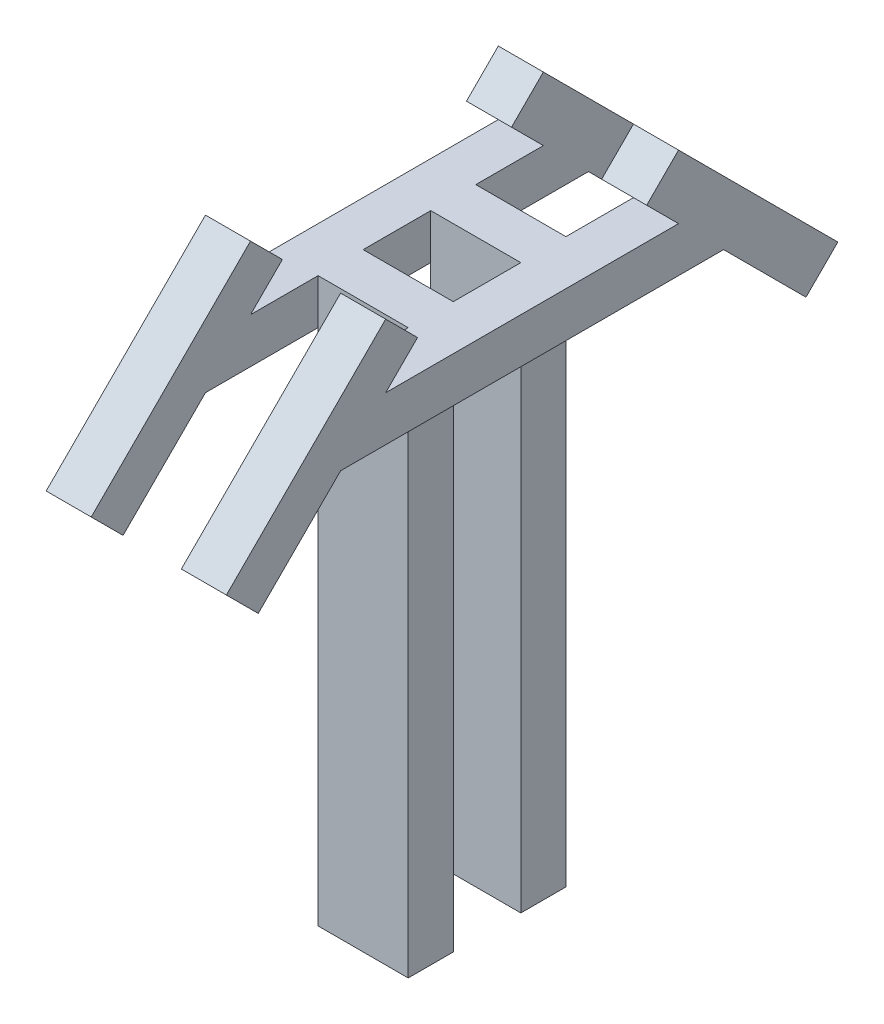
ISO-10303-21;
HEADER;
FILE_DESCRIPTION(('STEP AP214'),'2;1');
FILE_NAME('part.step','',(''),(''),'','','');
FILE_SCHEMA(('AUTOMOTIVE_DESIGN { 1 0 10303 214 1 1 1 1 }'));
ENDSEC;
DATA;
#1=APPLICATION_CONTEXT('core data for automotive mechanical design processes');
#2=APPLICATION_PROTOCOL_DEFINITION('international standard','automotive_design',2000,#1);
#3=PRODUCT_CONTEXT('',#1,'mechanical');
#4=PRODUCT('Part','Part','',(#3));
#5=PRODUCT_RELATED_PRODUCT_CATEGORY('part','',(#4));
#6=PRODUCT_DEFINITION_FORMATION('','',#4);
#7=PRODUCT_DEFINITION_CONTEXT('part definition',#1,'design');
#8=PRODUCT_DEFINITION('design','',#6,#7);
#9=PRODUCT_DEFINITION_SHAPE('','',#8);
#10=(LENGTH_UNIT() NAMED_UNIT(*) SI_UNIT(.MILLI.,.METRE.));
#11=(NAMED_UNIT(*) PLANE_ANGLE_UNIT() SI_UNIT($,.RADIAN.));
#12=(NAMED_UNIT(*) SI_UNIT($,.STERADIAN.) SOLID_ANGLE_UNIT());
#13=UNCERTAINTY_MEASURE_WITH_UNIT(LENGTH_MEASURE(1.E-05),#10,'distance_accuracy_value','');
#14=(GEOMETRIC_REPRESENTATION_CONTEXT(3) GLOBAL_UNCERTAINTY_ASSIGNED_CONTEXT((#13)) GLOBAL_UNIT_ASSIGNED_CONTEXT((#10,
#11,#12)) REPRESENTATION_CONTEXT('',''));
#15=CARTESIAN_POINT('',(0.,0.,0.));
#16=DIRECTION('',(0.,0.,1.));
#17=DIRECTION('',(1.,0.,0.));
#18=AXIS2_PLACEMENT_3D('',#15,#16,#17);
#19=CARTESIAN_POINT('',(0.,500.,0.));
#20=DIRECTION('',(1.,0.,0.));
#21=DIRECTION('',(0.,0.,-1.));
#22=AXIS2_PLACEMENT_3D('',#19,#20,#21);
#23=PLANE('',#22);
#24=DIRECTION('',(0.,0.,1.));
#25=VECTOR('',#24,1.);
#26=CARTESIAN_POINT('',(0.,460.,-200.));
#27=LINE('',#26,#25);
#28=CARTESIAN_POINT('',(0.,460.,0.));
#29=VERTEX_POINT('',#28);
#30=CARTESIAN_POINT('',(0.,460.,40.));
#31=VERTEX_POINT('',#30);
#32=EDGE_CURVE('E630',#29,#31,#27,.T.);
#33=ORIENTED_EDGE('',*,*,#32,.F.);
#34=DIRECTION('',(0.,-1.,0.));
#35=VECTOR('',#34,1.);
#36=CARTESIAN_POINT('',(0.,500.,0.));
#37=LINE('',#36,#35);
#38=CARTESIAN_POINT('',(0.,0.,0.));
#39=VERTEX_POINT('',#38);
#40=EDGE_CURVE('E479',#29,#39,#37,.T.);
#41=ORIENTED_EDGE('',*,*,#40,.T.);
#42=DIRECTION('',(0.,0.,1.));
#43=VECTOR('',#42,1.);
#44=CARTESIAN_POINT('',(0.,0.,0.));
#45=LINE('',#44,#43);
#46=CARTESIAN_POINT('',(0.,0.,40.));
#47=VERTEX_POINT('',#46);
#48=EDGE_CURVE('E472',#39,#47,#45,.T.);
#49=ORIENTED_EDGE('',*,*,#48,.T.);
#50=DIRECTION('',(0.,-1.,0.));
#51=VECTOR('',#50,1.);
#52=CARTESIAN_POINT('',(0.,500.,40.));
#53=LINE('',#52,#51);
#54=EDGE_CURVE('E497',#31,#47,#53,.T.);
#55=ORIENTED_EDGE('',*,*,#54,.F.);
#56=EDGE_LOOP('',(#33,#41,#49,#55));
#57=FACE_BOUND('',#56,.T.);
#58=ADVANCED_FACE('F37',(#57),#23,.F.);
#59=CARTESIAN_POINT('',(0.,500.,-100.));
#60=DIRECTION('',(1.,0.,0.));
#61=DIRECTION('',(0.,0.,-1.));
#62=AXIS2_PLACEMENT_3D('',#59,#60,#61);
#63=PLANE('',#62);
#64=CARTESIAN_POINT('',(0.,460.,-100.));
#65=VERTEX_POINT('',#64);
#66=CARTESIAN_POINT('',(0.,460.,-60.));
#67=VERTEX_POINT('',#66);
#68=EDGE_CURVE('E419',#65,#67,#27,.T.);
#69=ORIENTED_EDGE('',*,*,#68,.F.);
#70=DIRECTION('',(0.,-1.,0.));
#71=VECTOR('',#70,1.);
#72=CARTESIAN_POINT('',(0.,500.,-100.));
#73=LINE('',#72,#71);
#74=CARTESIAN_POINT('',(0.,0.,-100.));
#75=VERTEX_POINT('',#74);
#76=EDGE_CURVE('E433',#65,#75,#73,.T.);
#77=ORIENTED_EDGE('',*,*,#76,.T.);
#78=DIRECTION('',(0.,0.,1.));
#79=VECTOR('',#78,1.);
#80=CARTESIAN_POINT('',(0.,0.,-100.));
#81=LINE('',#80,#79);
#82=CARTESIAN_POINT('',(0.,0.,-60.));
#83=VERTEX_POINT('',#82);
#84=EDGE_CURVE('E427',#75,#83,#81,.T.);
#85=ORIENTED_EDGE('',*,*,#84,.T.);
#86=DIRECTION('',(0.,-1.,0.));
#87=VECTOR('',#86,1.);
#88=CARTESIAN_POINT('',(0.,500.,-60.));
#89=LINE('',#88,#87);
#90=EDGE_CURVE('E54',#67,#83,#89,.T.);
#91=ORIENTED_EDGE('',*,*,#90,.F.);
#92=EDGE_LOOP('',(#69,#77,#85,#91));
#93=FACE_BOUND('',#92,.T.);
#94=ADVANCED_FACE('F656',(#93),#63,.F.);
#95=CARTESIAN_POINT('',(80.,0.,0.));
#96=DIRECTION('',(1.,0.,0.));
#97=DIRECTION('',(0.,0.,-1.));
#98=AXIS2_PLACEMENT_3D('',#95,#96,#97);
#99=PLANE('',#98);
#100=DIRECTION('',(0.,-1.,0.));
#101=VECTOR('',#100,1.);
#102=CARTESIAN_POINT('',(80.,500.,-60.));
#103=LINE('',#102,#101);
#104=CARTESIAN_POINT('',(80.,500.,-60.));
#105=VERTEX_POINT('',#104);
#106=CARTESIAN_POINT('',(80.,460.,-60.));
#107=VERTEX_POINT('',#106);
#108=EDGE_CURVE('E62',#105,#107,#103,.T.);
#109=ORIENTED_EDGE('',*,*,#108,.T.);
#110=DIRECTION('',(0.,0.,-1.));
#111=VECTOR('',#110,1.);
#112=CARTESIAN_POINT('',(80.,460.,140.));
#113=LINE('',#112,#111);
#114=CARTESIAN_POINT('',(80.,460.,0.));
#115=VERTEX_POINT('',#114);
#116=EDGE_CURVE('E47',#115,#107,#113,.T.);
#117=ORIENTED_EDGE('',*,*,#116,.F.);
#118=DIRECTION('',(0.,-1.,0.));
#119=VECTOR('',#118,1.);
#120=CARTESIAN_POINT('',(80.,500.,0.));
#121=LINE('',#120,#119);
#122=CARTESIAN_POINT('',(80.,500.,0.));
#123=VERTEX_POINT('',#122);
#124=EDGE_CURVE('E493',#123,#115,#121,.T.);
#125=ORIENTED_EDGE('',*,*,#124,.F.);
#126=DIRECTION('',(0.,0.,1.));
#127=VECTOR('',#126,1.);
#128=CARTESIAN_POINT('',(80.,500.,140.));
#129=LINE('',#128,#127);
#130=EDGE_CURVE('E466',#105,#123,#129,.T.);
#131=ORIENTED_EDGE('',*,*,#130,.F.);
#132=EDGE_LOOP('',(#109,#117,#125,#131));
#133=FACE_BOUND('',#132,.T.);
#134=ADVANCED_FACE('F525',(#133),#99,.F.);
#135=CARTESIAN_POINT('',(80.,500.,-160.000000000001));
#136=VERTEX_POINT('',#135);
#137=CARTESIAN_POINT('',(80.,500.,-100.));
#138=VERTEX_POINT('',#137);
#139=EDGE_CURVE('E459',#136,#138,#129,.T.);
#140=ORIENTED_EDGE('',*,*,#139,.F.);
#141=DIRECTION('',(0.,0.707106781186551,0.707106781186544));
#142=VECTOR('',#141,1.);
#143=CARTESIAN_POINT('',(80.,528.284271247462,-131.715728752539));
#144=LINE('',#143,#142);
#145=CARTESIAN_POINT('',(80.,528.284271247462,-131.715728752539));
#146=VERTEX_POINT('',#145);
#147=EDGE_CURVE('E321',#136,#146,#144,.T.);
#148=ORIENTED_EDGE('',*,*,#147,.T.);
#149=DIRECTION('',(0.,-0.707106781186544,0.707106781186551));
#150=VECTOR('',#149,1.);
#151=CARTESIAN_POINT('',(80.,556.568542494924,-160.000000000001));
#152=LINE('',#151,#150);
#153=CARTESIAN_POINT('',(80.,556.568542494924,-160.000000000001));
#154=VERTEX_POINT('',#153);
#155=EDGE_CURVE('E327',#154,#146,#152,.T.);
#156=ORIENTED_EDGE('',*,*,#155,.F.);
#157=DIRECTION('',(0.,0.707106781186551,0.707106781186544));
#158=VECTOR('',#157,1.);
#159=CARTESIAN_POINT('',(80.,556.568542494924,-160.000000000001));
#160=LINE('',#159,#158);
#161=CARTESIAN_POINT('',(80.,415.147186257613,-301.42135623731));
#162=VERTEX_POINT('',#161);
#163=EDGE_CURVE('E313',#162,#154,#160,.T.);
#164=ORIENTED_EDGE('',*,*,#163,.F.);
#165=DIRECTION('',(0.,-0.707106781186544,0.707106781186551));
#166=VECTOR('',#165,1.);
#167=CARTESIAN_POINT('',(80.,415.147186257613,-301.42135623731));
#168=LINE('',#167,#166);
#169=CARTESIAN_POINT('',(80.,386.862915010152,-273.137084989847));
#170=VERTEX_POINT('',#169);
#171=EDGE_CURVE('E330',#162,#170,#168,.T.);
#172=ORIENTED_EDGE('',*,*,#171,.T.);
#173=CARTESIAN_POINT('',(80.,460.,-200.));
#174=VERTEX_POINT('',#173);
#175=EDGE_CURVE('E322',#170,#174,#144,.T.);
#176=ORIENTED_EDGE('',*,*,#175,.T.);
#177=CARTESIAN_POINT('',(80.,460.,-100.));
#178=VERTEX_POINT('',#177);
#179=EDGE_CURVE('E454',#178,#174,#113,.T.);
#180=ORIENTED_EDGE('',*,*,#179,.F.);
#181=DIRECTION('',(0.,-1.,0.));
#182=VECTOR('',#181,1.);
#183=CARTESIAN_POINT('',(80.,500.,-100.));
#184=LINE('',#183,#182);
#185=EDGE_CURVE('E447',#138,#178,#184,.T.);
#186=ORIENTED_EDGE('',*,*,#185,.F.);
#187=EDGE_LOOP('',(#140,#148,#156,#164,#172,#176,#180,#186));
#188=FACE_BOUND('',#187,.T.);
#189=ADVANCED_FACE('F572',(#188),#99,.F.);
#190=CARTESIAN_POINT('',(80.,500.,0.));
#191=DIRECTION('',(-1.,0.,0.));
#192=DIRECTION('',(0.,0.,1.));
#193=AXIS2_PLACEMENT_3D('',#190,#191,#192);
#194=PLANE('',#193);
#195=CARTESIAN_POINT('',(80.,460.,40.));
#196=VERTEX_POINT('',#195);
#197=EDGE_CURVE('E11',#196,#115,#113,.T.);
#198=ORIENTED_EDGE('',*,*,#197,.F.);
#199=DIRECTION('',(0.,-1.,0.));
#200=VECTOR('',#199,1.);
#201=CARTESIAN_POINT('',(80.,500.,40.));
#202=LINE('',#201,#200);
#203=CARTESIAN_POINT('',(80.,0.,40.));
#204=VERTEX_POINT('',#203);
#205=EDGE_CURVE('E494',#196,#204,#202,.T.);
#206=ORIENTED_EDGE('',*,*,#205,.T.);
#207=DIRECTION('',(0.,0.,-1.));
#208=VECTOR('',#207,1.);
#209=CARTESIAN_POINT('',(80.,0.,0.));
#210=LINE('',#209,#208);
#211=CARTESIAN_POINT('',(80.,0.,0.));
#212=VERTEX_POINT('',#211);
#213=EDGE_CURVE('E485',#204,#212,#210,.T.);
#214=ORIENTED_EDGE('',*,*,#213,.T.);
#215=EDGE_CURVE('E492',#115,#212,#121,.T.);
#216=ORIENTED_EDGE('',*,*,#215,.F.);
#217=EDGE_LOOP('',(#198,#206,#214,#216));
#218=FACE_BOUND('',#217,.T.);
#219=ADVANCED_FACE('F504',(#218),#194,.F.);
#220=CARTESIAN_POINT('',(0.,500.,40.));
#221=DIRECTION('',(0.,0.,-1.));
#222=DIRECTION('',(-1.,0.,0.));
#223=AXIS2_PLACEMENT_3D('',#220,#221,#222);
#224=PLANE('',#223);
#225=DIRECTION('',(1.,0.,0.));
#226=VECTOR('',#225,1.);
#227=CARTESIAN_POINT('',(0.,0.,40.));
#228=LINE('',#227,#226);
#229=EDGE_CURVE('E482',#47,#204,#228,.T.);
#230=ORIENTED_EDGE('',*,*,#229,.T.);
#231=ORIENTED_EDGE('',*,*,#205,.F.);
#232=CARTESIAN_POINT('',(80.,500.,40.));
#233=VERTEX_POINT('',#232);
#234=EDGE_CURVE('E495',#233,#196,#202,.T.);
#235=ORIENTED_EDGE('',*,*,#234,.F.);
#236=DIRECTION('',(1.,0.,0.));
#237=VECTOR('',#236,1.);
#238=CARTESIAN_POINT('',(0.,500.,40.));
#239=LINE('',#238,#237);
#240=CARTESIAN_POINT('',(0.,500.,40.));
#241=VERTEX_POINT('',#240);
#242=EDGE_CURVE('E473',#241,#233,#239,.T.);
#243=ORIENTED_EDGE('',*,*,#242,.F.);
#244=EDGE_CURVE('E40',#241,#31,#53,.T.);
#245=ORIENTED_EDGE('',*,*,#244,.T.);
#246=ORIENTED_EDGE('',*,*,#54,.T.);
#247=EDGE_LOOP('',(#230,#231,#235,#243,#245,#246));
#248=FACE_BOUND('',#247,.T.);
#249=ADVANCED_FACE('F510',(#248),#224,.F.);
#250=CARTESIAN_POINT('',(0.,500.,0.));
#251=DIRECTION('',(0.,0.,1.));
#252=DIRECTION('',(1.,0.,0.));
#253=AXIS2_PLACEMENT_3D('',#250,#251,#252);
#254=PLANE('',#253);
#255=DIRECTION('',(-1.,0.,0.));
#256=VECTOR('',#255,1.);
#257=CARTESIAN_POINT('',(0.,0.,0.));
#258=LINE('',#257,#256);
#259=EDGE_CURVE('E476',#212,#39,#258,.T.);
#260=ORIENTED_EDGE('',*,*,#259,.T.);
#261=ORIENTED_EDGE('',*,*,#40,.F.);
#262=CARTESIAN_POINT('',(0.,500.,0.));
#263=VERTEX_POINT('',#262);
#264=EDGE_CURVE('E490',#263,#29,#37,.T.);
#265=ORIENTED_EDGE('',*,*,#264,.F.);
#266=DIRECTION('',(-1.,0.,0.));
#267=VECTOR('',#266,1.);
#268=CARTESIAN_POINT('',(0.,500.,0.));
#269=LINE('',#268,#267);
#270=EDGE_CURVE('E475',#123,#263,#269,.T.);
#271=ORIENTED_EDGE('',*,*,#270,.F.);
#272=ORIENTED_EDGE('',*,*,#124,.T.);
#273=ORIENTED_EDGE('',*,*,#215,.T.);
#274=EDGE_LOOP('',(#260,#261,#265,#271,#272,#273));
#275=FACE_BOUND('',#274,.T.);
#276=ADVANCED_FACE('F518',(#275),#254,.F.);
#277=CARTESIAN_POINT('',(0.,500.,0.));
#278=DIRECTION('',(0.,1.,0.));
#279=DIRECTION('',(0.,0.,1.));
#280=AXIS2_PLACEMENT_3D('',#277,#278,#279);
#281=PLANE('',#280);
#282=DIRECTION('',(-1.,0.,0.));
#283=VECTOR('',#282,1.);
#284=CARTESIAN_POINT('',(120.,500.,99.9999999999999));
#285=LINE('',#284,#283);
#286=CARTESIAN_POINT('',(120.,500.,99.9999999999999));
#287=VERTEX_POINT('',#286);
#288=CARTESIAN_POINT('',(80.,500.,99.9999999999999));
#289=VERTEX_POINT('',#288);
#290=EDGE_CURVE('E401',#287,#289,#285,.T.);
#291=ORIENTED_EDGE('',*,*,#290,.F.);
#292=DIRECTION('',(0.,0.,1.));
#293=VECTOR('',#292,1.);
#294=CARTESIAN_POINT('',(120.,500.,140.));
#295=LINE('',#294,#293);
#296=CARTESIAN_POINT('',(120.,500.,-160.000000000001));
#297=VERTEX_POINT('',#296);
#298=EDGE_CURVE('E458',#297,#287,#295,.T.);
#299=ORIENTED_EDGE('',*,*,#298,.F.);
#300=DIRECTION('',(-1.,0.,0.));
#301=VECTOR('',#300,1.);
#302=CARTESIAN_POINT('',(120.,500.,-160.000000000001));
#303=LINE('',#302,#301);
#304=EDGE_CURVE('E405',#297,#136,#303,.T.);
#305=ORIENTED_EDGE('',*,*,#304,.T.);
#306=ORIENTED_EDGE('',*,*,#139,.T.);
#307=DIRECTION('',(-1.,0.,0.));
#308=VECTOR('',#307,1.);
#309=CARTESIAN_POINT('',(0.,500.,-100.));
#310=LINE('',#309,#308);
#311=CARTESIAN_POINT('',(0.,500.,-100.));
#312=VERTEX_POINT('',#311);
#313=EDGE_CURVE('E430',#138,#312,#310,.T.);
#314=ORIENTED_EDGE('',*,*,#313,.T.);
#315=DIRECTION('',(0.,0.,-1.));
#316=VECTOR('',#315,1.);
#317=CARTESIAN_POINT('',(0.,500.,-200.));
#318=LINE('',#317,#316);
#319=CARTESIAN_POINT('',(0.,500.,-160.000000000001));
#320=VERTEX_POINT('',#319);
#321=EDGE_CURVE('E418',#312,#320,#318,.T.);
#322=ORIENTED_EDGE('',*,*,#321,.T.);
#323=CARTESIAN_POINT('',(-40.0000000000001,500.,-160.));
#324=VERTEX_POINT('',#323);
#325=EDGE_CURVE('E400',#320,#324,#303,.T.);
#326=ORIENTED_EDGE('',*,*,#325,.T.);
#327=DIRECTION('',(0.,0.,-1.));
#328=VECTOR('',#327,1.);
#329=CARTESIAN_POINT('',(-40.0000000000001,500.,-200.));
#330=LINE('',#329,#328);
#331=CARTESIAN_POINT('',(-40.,500.,99.9999999999999));
#332=VERTEX_POINT('',#331);
#333=EDGE_CURVE('E411',#332,#324,#330,.T.);
#334=ORIENTED_EDGE('',*,*,#333,.F.);
#335=CARTESIAN_POINT('',(0.,500.,99.9999999999999));
#336=VERTEX_POINT('',#335);
#337=EDGE_CURVE('E404',#336,#332,#285,.T.);
#338=ORIENTED_EDGE('',*,*,#337,.F.);
#339=EDGE_CURVE('E412',#336,#241,#318,.T.);
#340=ORIENTED_EDGE('',*,*,#339,.T.);
#341=ORIENTED_EDGE('',*,*,#242,.T.);
#342=EDGE_CURVE('E464',#233,#289,#129,.T.);
#343=ORIENTED_EDGE('',*,*,#342,.T.);
#344=EDGE_LOOP('',(#291,#299,#305,#306,#314,#322,#326,#334,#338,#340,#341,#343));
#345=FACE_BOUND('',#344,.T.);
#346=ORIENTED_EDGE('',*,*,#270,.T.);
#347=CARTESIAN_POINT('',(0.,500.,-60.));
#348=VERTEX_POINT('',#347);
#349=EDGE_CURVE('E421',#263,#348,#318,.T.);
#350=ORIENTED_EDGE('',*,*,#349,.T.);
#351=DIRECTION('',(1.,0.,0.));
#352=VECTOR('',#351,1.);
#353=CARTESIAN_POINT('',(0.,500.,-60.));
#354=LINE('',#353,#352);
#355=EDGE_CURVE('E428',#348,#105,#354,.T.);
#356=ORIENTED_EDGE('',*,*,#355,.T.);
#357=ORIENTED_EDGE('',*,*,#130,.T.);
#358=EDGE_LOOP('',(#346,#350,#356,#357));
#359=FACE_BOUND('',#358,.T.);
#360=ADVANCED_FACE('F557',(#345,#359),#281,.T.);
#361=CARTESIAN_POINT('',(0.,0.,0.));
#362=DIRECTION('',(0.,1.,0.));
#363=DIRECTION('',(0.,0.,1.));
#364=AXIS2_PLACEMENT_3D('',#361,#362,#363);
#365=PLANE('',#364);
#366=ORIENTED_EDGE('',*,*,#48,.F.);
#367=ORIENTED_EDGE('',*,*,#259,.F.);
#368=ORIENTED_EDGE('',*,*,#213,.F.);
#369=ORIENTED_EDGE('',*,*,#229,.F.);
#370=EDGE_LOOP('',(#366,#367,#368,#369));
#371=FACE_BOUND('',#370,.T.);
#372=ADVANCED_FACE('F515',(#371),#365,.F.);
#373=CARTESIAN_POINT('',(80.,460.,140.));
#374=VERTEX_POINT('',#373);
#375=EDGE_CURVE('E46',#374,#196,#113,.T.);
#376=ORIENTED_EDGE('',*,*,#375,.F.);
#377=DIRECTION('',(0.,-0.707106781186546,0.707106781186549));
#378=VECTOR('',#377,1.);
#379=CARTESIAN_POINT('',(80.,528.284271247462,71.715728752538));
#380=LINE('',#379,#378);
#381=CARTESIAN_POINT('',(80.0000000000001,386.862915010153,213.137084989848));
#382=VERTEX_POINT('',#381);
#383=EDGE_CURVE('E336',#374,#382,#380,.T.);
#384=ORIENTED_EDGE('',*,*,#383,.T.);
#385=DIRECTION('',(0.,-0.707106781186549,-0.707106781186546));
#386=VECTOR('',#385,1.);
#387=CARTESIAN_POINT('',(80.0000000000001,415.147186257615,241.42135623731));
#388=LINE('',#387,#386);
#389=CARTESIAN_POINT('',(80.0000000000001,415.147186257615,241.42135623731));
#390=VERTEX_POINT('',#389);
#391=EDGE_CURVE('E365',#390,#382,#388,.T.);
#392=ORIENTED_EDGE('',*,*,#391,.F.);
#393=DIRECTION('',(0.,-0.707106781186546,0.707106781186549));
#394=VECTOR('',#393,1.);
#395=CARTESIAN_POINT('',(80.,556.568542494924,99.9999999999998));
#396=LINE('',#395,#394);
#397=CARTESIAN_POINT('',(80.,556.568542494924,99.9999999999998));
#398=VERTEX_POINT('',#397);
#399=EDGE_CURVE('E337',#398,#390,#396,.T.);
#400=ORIENTED_EDGE('',*,*,#399,.F.);
#401=DIRECTION('',(0.,-0.707106781186549,-0.707106781186546));
#402=VECTOR('',#401,1.);
#403=CARTESIAN_POINT('',(80.,556.568542494924,99.9999999999998));
#404=LINE('',#403,#402);
#405=CARTESIAN_POINT('',(80.,528.284271247462,71.715728752538));
#406=VERTEX_POINT('',#405);
#407=EDGE_CURVE('E347',#398,#406,#404,.T.);
#408=ORIENTED_EDGE('',*,*,#407,.T.);
#409=EDGE_CURVE('E348',#406,#289,#380,.T.);
#410=ORIENTED_EDGE('',*,*,#409,.T.);
#411=ORIENTED_EDGE('',*,*,#342,.F.);
#412=ORIENTED_EDGE('',*,*,#234,.T.);
#413=EDGE_LOOP('',(#376,#384,#392,#400,#408,#410,#411,#412));
#414=FACE_BOUND('',#413,.T.);
#415=ADVANCED_FACE('F533',(#414),#99,.F.);
#416=CARTESIAN_POINT('',(120.,460.,140.));
#417=DIRECTION('',(0.,1.,0.));
#418=DIRECTION('',(0.,0.,1.));
#419=AXIS2_PLACEMENT_3D('',#416,#417,#418);
#420=PLANE('',#419);
#421=ORIENTED_EDGE('',*,*,#375,.T.);
#422=ORIENTED_EDGE('',*,*,#197,.T.);
#423=ORIENTED_EDGE('',*,*,#116,.T.);
#424=EDGE_CURVE('E529',#107,#178,#113,.T.);
#425=ORIENTED_EDGE('',*,*,#424,.T.);
#426=ORIENTED_EDGE('',*,*,#179,.T.);
#427=DIRECTION('',(-1.,0.,0.));
#428=VECTOR('',#427,1.);
#429=CARTESIAN_POINT('',(120.,460.,-200.));
#430=LINE('',#429,#428);
#431=CARTESIAN_POINT('',(120.,460.,-200.));
#432=VERTEX_POINT('',#431);
#433=EDGE_CURVE('E461',#432,#174,#430,.T.);
#434=ORIENTED_EDGE('',*,*,#433,.F.);
#435=DIRECTION('',(0.,0.,-1.));
#436=VECTOR('',#435,1.);
#437=CARTESIAN_POINT('',(120.,460.,140.));
#438=LINE('',#437,#436);
#439=CARTESIAN_POINT('',(120.,460.,140.));
#440=VERTEX_POINT('',#439);
#441=EDGE_CURVE('E455',#440,#432,#438,.T.);
#442=ORIENTED_EDGE('',*,*,#441,.F.);
#443=DIRECTION('',(-1.,0.,0.));
#444=VECTOR('',#443,1.);
#445=CARTESIAN_POINT('',(120.,460.,140.));
#446=LINE('',#445,#444);
#447=EDGE_CURVE('E469',#440,#374,#446,.T.);
#448=ORIENTED_EDGE('',*,*,#447,.T.);
#449=EDGE_LOOP('',(#421,#422,#423,#425,#426,#434,#442,#448));
#450=FACE_BOUND('',#449,.T.);
#451=ADVANCED_FACE('F530',(#450),#420,.F.);
#452=CARTESIAN_POINT('',(120.,0.,0.));
#453=DIRECTION('',(1.,0.,0.));
#454=DIRECTION('',(0.,0.,-1.));
#455=AXIS2_PLACEMENT_3D('',#452,#453,#454);
#456=PLANE('',#455);
#457=ORIENTED_EDGE('',*,*,#298,.T.);
#458=DIRECTION('',(0.,0.707106781186546,-0.707106781186549));
#459=VECTOR('',#458,1.);
#460=CARTESIAN_POINT('',(120.,528.284271247462,71.715728752538));
#461=LINE('',#460,#459);
#462=CARTESIAN_POINT('',(120.,528.284271247462,71.715728752538));
#463=VERTEX_POINT('',#462);
#464=EDGE_CURVE('E353',#287,#463,#461,.T.);
#465=ORIENTED_EDGE('',*,*,#464,.T.);
#466=DIRECTION('',(0.,-0.707106781186549,-0.707106781186546));
#467=VECTOR('',#466,1.);
#468=CARTESIAN_POINT('',(120.,556.568542494924,99.9999999999998));
#469=LINE('',#468,#467);
#470=CARTESIAN_POINT('',(120.,556.568542494924,99.9999999999998));
#471=VERTEX_POINT('',#470);
#472=EDGE_CURVE('E359',#471,#463,#469,.T.);
#473=ORIENTED_EDGE('',*,*,#472,.F.);
#474=DIRECTION('',(0.,0.707106781186546,-0.707106781186549));
#475=VECTOR('',#474,1.);
#476=CARTESIAN_POINT('',(120.,556.568542494924,99.9999999999998));
#477=LINE('',#476,#475);
#478=CARTESIAN_POINT('',(120.,415.147186257615,241.42135623731));
#479=VERTEX_POINT('',#478);
#480=EDGE_CURVE('E343',#479,#471,#477,.T.);
#481=ORIENTED_EDGE('',*,*,#480,.F.);
#482=DIRECTION('',(0.,-0.707106781186549,-0.707106781186546));
#483=VECTOR('',#482,1.);
#484=CARTESIAN_POINT('',(120.,415.147186257615,241.42135623731));
#485=LINE('',#484,#483);
#486=CARTESIAN_POINT('',(120.,386.862915010153,213.137084989848));
#487=VERTEX_POINT('',#486);
#488=EDGE_CURVE('E362',#479,#487,#485,.T.);
#489=ORIENTED_EDGE('',*,*,#488,.T.);
#490=EDGE_CURVE('E354',#487,#440,#461,.T.);
#491=ORIENTED_EDGE('',*,*,#490,.T.);
#492=ORIENTED_EDGE('',*,*,#441,.T.);
#493=DIRECTION('',(0.,-0.707106781186551,-0.707106781186543));
#494=VECTOR('',#493,1.);
#495=CARTESIAN_POINT('',(120.,528.284271247462,-131.715728752539));
#496=LINE('',#495,#494);
#497=CARTESIAN_POINT('',(120.,386.862915010152,-273.137084989847));
#498=VERTEX_POINT('',#497);
#499=EDGE_CURVE('E299',#432,#498,#496,.T.);
#500=ORIENTED_EDGE('',*,*,#499,.T.);
#501=DIRECTION('',(0.,-0.707106781186544,0.707106781186551));
#502=VECTOR('',#501,1.);
#503=CARTESIAN_POINT('',(120.,415.147186257613,-301.42135623731));
#504=LINE('',#503,#502);
#505=CARTESIAN_POINT('',(120.,415.147186257613,-301.42135623731));
#506=VERTEX_POINT('',#505);
#507=EDGE_CURVE('E333',#506,#498,#504,.T.);
#508=ORIENTED_EDGE('',*,*,#507,.F.);
#509=DIRECTION('',(0.,-0.707106781186551,-0.707106781186543));
#510=VECTOR('',#509,1.);
#511=CARTESIAN_POINT('',(120.,556.568542494924,-160.000000000001));
#512=LINE('',#511,#510);
#513=CARTESIAN_POINT('',(120.,556.568542494924,-160.000000000001));
#514=VERTEX_POINT('',#513);
#515=EDGE_CURVE('E307',#514,#506,#512,.T.);
#516=ORIENTED_EDGE('',*,*,#515,.F.);
#517=DIRECTION('',(0.,-0.707106781186544,0.707106781186551));
#518=VECTOR('',#517,1.);
#519=CARTESIAN_POINT('',(120.,556.568542494924,-160.000000000001));
#520=LINE('',#519,#518);
#521=CARTESIAN_POINT('',(120.,528.284271247462,-131.715728752539));
#522=VERTEX_POINT('',#521);
#523=EDGE_CURVE('E316',#514,#522,#520,.T.);
#524=ORIENTED_EDGE('',*,*,#523,.T.);
#525=EDGE_CURVE('E301',#522,#297,#496,.T.);
#526=ORIENTED_EDGE('',*,*,#525,.T.);
#527=EDGE_LOOP('',(#457,#465,#473,#481,#489,#491,#492,#500,#508,#516,#524,#526));
#528=FACE_BOUND('',#527,.T.);
#529=ADVANCED_FACE('F560',(#528),#456,.T.);
#530=CARTESIAN_POINT('',(80.,500.,-100.));
#531=DIRECTION('',(-1.,0.,0.));
#532=DIRECTION('',(0.,0.,1.));
#533=AXIS2_PLACEMENT_3D('',#530,#531,#532);
#534=PLANE('',#533);
#535=CARTESIAN_POINT('',(80.,0.,-100.));
#536=VERTEX_POINT('',#535);
#537=EDGE_CURVE('E446',#178,#536,#184,.T.);
#538=ORIENTED_EDGE('',*,*,#537,.F.);
#539=ORIENTED_EDGE('',*,*,#424,.F.);
#540=CARTESIAN_POINT('',(80.,0.,-60.));
#541=VERTEX_POINT('',#540);
#542=EDGE_CURVE('E450',#107,#541,#103,.T.);
#543=ORIENTED_EDGE('',*,*,#542,.T.);
#544=DIRECTION('',(0.,0.,-1.));
#545=VECTOR('',#544,1.);
#546=CARTESIAN_POINT('',(80.,0.,-100.));
#547=LINE('',#546,#545);
#548=EDGE_CURVE('E438',#541,#536,#547,.T.);
#549=ORIENTED_EDGE('',*,*,#548,.T.);
#550=EDGE_LOOP('',(#538,#539,#543,#549));
#551=FACE_BOUND('',#550,.T.);
#552=ADVANCED_FACE('F670',(#551),#534,.F.);
#553=CARTESIAN_POINT('',(0.,500.,-60.));
#554=DIRECTION('',(0.,0.,-1.));
#555=DIRECTION('',(-1.,0.,0.));
#556=AXIS2_PLACEMENT_3D('',#553,#554,#555);
#557=PLANE('',#556);
#558=DIRECTION('',(1.,0.,0.));
#559=VECTOR('',#558,1.);
#560=CARTESIAN_POINT('',(0.,0.,-60.));
#561=LINE('',#560,#559);
#562=EDGE_CURVE('E435',#83,#541,#561,.T.);
#563=ORIENTED_EDGE('',*,*,#562,.T.);
#564=ORIENTED_EDGE('',*,*,#542,.F.);
#565=ORIENTED_EDGE('',*,*,#108,.F.);
#566=ORIENTED_EDGE('',*,*,#355,.F.);
#567=EDGE_CURVE('E452',#348,#67,#89,.T.);
#568=ORIENTED_EDGE('',*,*,#567,.T.);
#569=ORIENTED_EDGE('',*,*,#90,.T.);
#570=EDGE_LOOP('',(#563,#564,#565,#566,#568,#569));
#571=FACE_BOUND('',#570,.T.);
#572=ADVANCED_FACE('F667',(#571),#557,.F.);
#573=CARTESIAN_POINT('',(0.,500.,-100.));
#574=DIRECTION('',(0.,0.,1.));
#575=DIRECTION('',(1.,0.,0.));
#576=AXIS2_PLACEMENT_3D('',#573,#574,#575);
#577=PLANE('',#576);
#578=DIRECTION('',(-1.,0.,0.));
#579=VECTOR('',#578,1.);
#580=CARTESIAN_POINT('',(0.,0.,-100.));
#581=LINE('',#580,#579);
#582=EDGE_CURVE('E431',#536,#75,#581,.T.);
#583=ORIENTED_EDGE('',*,*,#582,.T.);
#584=ORIENTED_EDGE('',*,*,#76,.F.);
#585=EDGE_CURVE('E443',#312,#65,#73,.T.);
#586=ORIENTED_EDGE('',*,*,#585,.F.);
#587=ORIENTED_EDGE('',*,*,#313,.F.);
#588=ORIENTED_EDGE('',*,*,#185,.T.);
#589=ORIENTED_EDGE('',*,*,#537,.T.);
#590=EDGE_LOOP('',(#583,#584,#586,#587,#588,#589));
#591=FACE_BOUND('',#590,.T.);
#592=ADVANCED_FACE('F577',(#591),#577,.F.);
#593=CARTESIAN_POINT('',(0.,0.,0.));
#594=DIRECTION('',(0.,1.,0.));
#595=DIRECTION('',(0.,0.,1.));
#596=AXIS2_PLACEMENT_3D('',#593,#594,#595);
#597=PLANE('',#596);
#598=ORIENTED_EDGE('',*,*,#84,.F.);
#599=ORIENTED_EDGE('',*,*,#582,.F.);
#600=ORIENTED_EDGE('',*,*,#548,.F.);
#601=ORIENTED_EDGE('',*,*,#562,.F.);
#602=EDGE_LOOP('',(#598,#599,#600,#601));
#603=FACE_BOUND('',#602,.T.);
#604=ADVANCED_FACE('F732',(#603),#597,.F.);
#605=CARTESIAN_POINT('',(0.,0.,0.));
#606=DIRECTION('',(-1.,0.,0.));
#607=DIRECTION('',(0.,0.,1.));
#608=AXIS2_PLACEMENT_3D('',#605,#606,#607);
#609=PLANE('',#608);
#610=ORIENTED_EDGE('',*,*,#339,.F.);
#611=DIRECTION('',(0.,0.707106781186546,-0.707106781186549));
#612=VECTOR('',#611,1.);
#613=CARTESIAN_POINT('',(0.,528.284271247462,71.715728752538));
#614=LINE('',#613,#612);
#615=CARTESIAN_POINT('',(0.,528.284271247462,71.715728752538));
#616=VERTEX_POINT('',#615);
#617=EDGE_CURVE('E385',#336,#616,#614,.T.);
#618=ORIENTED_EDGE('',*,*,#617,.T.);
#619=DIRECTION('',(0.,-0.707106781186549,-0.707106781186546));
#620=VECTOR('',#619,1.);
#621=CARTESIAN_POINT('',(0.,556.568542494924,99.9999999999998));
#622=LINE('',#621,#620);
#623=CARTESIAN_POINT('',(0.,556.568542494924,99.9999999999998));
#624=VERTEX_POINT('',#623);
#625=EDGE_CURVE('E391',#624,#616,#622,.T.);
#626=ORIENTED_EDGE('',*,*,#625,.F.);
#627=DIRECTION('',(0.,0.707106781186546,-0.707106781186549));
#628=VECTOR('',#627,1.);
#629=CARTESIAN_POINT('',(0.,556.568542494924,99.9999999999998));
#630=LINE('',#629,#628);
#631=CARTESIAN_POINT('',(0.,415.147186257615,241.42135623731));
#632=VERTEX_POINT('',#631);
#633=EDGE_CURVE('E375',#632,#624,#630,.T.);
#634=ORIENTED_EDGE('',*,*,#633,.F.);
#635=DIRECTION('',(0.,-0.707106781186549,-0.707106781186546));
#636=VECTOR('',#635,1.);
#637=CARTESIAN_POINT('',(0.,415.147186257615,241.42135623731));
#638=LINE('',#637,#636);
#639=CARTESIAN_POINT('',(0.,386.862915010153,213.137084989848));
#640=VERTEX_POINT('',#639);
#641=EDGE_CURVE('E394',#632,#640,#638,.T.);
#642=ORIENTED_EDGE('',*,*,#641,.T.);
#643=CARTESIAN_POINT('',(0.,460.,140.));
#644=VERTEX_POINT('',#643);
#645=EDGE_CURVE('E386',#640,#644,#614,.T.);
#646=ORIENTED_EDGE('',*,*,#645,.T.);
#647=EDGE_CURVE('E403',#31,#644,#27,.T.);
#648=ORIENTED_EDGE('',*,*,#647,.F.);
#649=ORIENTED_EDGE('',*,*,#244,.F.);
#650=EDGE_LOOP('',(#610,#618,#626,#634,#642,#646,#648,#649));
#651=FACE_BOUND('',#650,.T.);
#652=ADVANCED_FACE('F614',(#651),#609,.F.);
#653=ORIENTED_EDGE('',*,*,#349,.F.);
#654=ORIENTED_EDGE('',*,*,#264,.T.);
#655=EDGE_CURVE('E625',#67,#29,#27,.T.);
#656=ORIENTED_EDGE('',*,*,#655,.F.);
#657=ORIENTED_EDGE('',*,*,#567,.F.);
#658=EDGE_LOOP('',(#653,#654,#656,#657));
#659=FACE_BOUND('',#658,.T.);
#660=ADVANCED_FACE('F623',(#659),#609,.F.);
#661=CARTESIAN_POINT('',(0.,460.,-200.));
#662=VERTEX_POINT('',#661);
#663=EDGE_CURVE('E415',#662,#65,#27,.T.);
#664=ORIENTED_EDGE('',*,*,#663,.F.);
#665=DIRECTION('',(0.,-0.707106781186551,-0.707106781186543));
#666=VECTOR('',#665,1.);
#667=CARTESIAN_POINT('',(0.,528.284271247462,-131.715728752539));
#668=LINE('',#667,#666);
#669=CARTESIAN_POINT('',(0.,386.862915010152,-273.137084989847));
#670=VERTEX_POINT('',#669);
#671=EDGE_CURVE('E297',#662,#670,#668,.T.);
#672=ORIENTED_EDGE('',*,*,#671,.T.);
#673=DIRECTION('',(0.,-0.707106781186544,0.707106781186551));
#674=VECTOR('',#673,1.);
#675=CARTESIAN_POINT('',(0.,415.147186257613,-301.42135623731));
#676=LINE('',#675,#674);
#677=CARTESIAN_POINT('',(0.,415.147186257613,-301.42135623731));
#678=VERTEX_POINT('',#677);
#679=EDGE_CURVE('E278',#678,#670,#676,.T.);
#680=ORIENTED_EDGE('',*,*,#679,.F.);
#681=DIRECTION('',(0.,-0.707106781186551,-0.707106781186543));
#682=VECTOR('',#681,1.);
#683=CARTESIAN_POINT('',(0.,556.568542494924,-160.000000000001));
#684=LINE('',#683,#682);
#685=CARTESIAN_POINT('',(0.,556.568542494924,-160.000000000001));
#686=VERTEX_POINT('',#685);
#687=EDGE_CURVE('E284',#686,#678,#684,.T.);
#688=ORIENTED_EDGE('',*,*,#687,.F.);
#689=DIRECTION('',(0.,-0.707106781186544,0.707106781186551));
#690=VECTOR('',#689,1.);
#691=CARTESIAN_POINT('',(0.,556.568542494924,-160.000000000001));
#692=LINE('',#691,#690);
#693=CARTESIAN_POINT('',(0.,528.284271247462,-131.715728752539));
#694=VERTEX_POINT('',#693);
#695=EDGE_CURVE('E591',#686,#694,#692,.T.);
#696=ORIENTED_EDGE('',*,*,#695,.T.);
#697=EDGE_CURVE('E589',#694,#320,#668,.T.);
#698=ORIENTED_EDGE('',*,*,#697,.T.);
#699=ORIENTED_EDGE('',*,*,#321,.F.);
#700=ORIENTED_EDGE('',*,*,#585,.T.);
#701=EDGE_LOOP('',(#664,#672,#680,#688,#696,#698,#699,#700));
#702=FACE_BOUND('',#701,.T.);
#703=ADVANCED_FACE('F295',(#702),#609,.F.);
#704=CARTESIAN_POINT('',(-40.0000000000001,460.,-200.));
#705=DIRECTION('',(0.,1.,0.));
#706=DIRECTION('',(0.,0.,1.));
#707=AXIS2_PLACEMENT_3D('',#704,#705,#706);
#708=PLANE('',#707);
#709=ORIENTED_EDGE('',*,*,#663,.T.);
#710=ORIENTED_EDGE('',*,*,#68,.T.);
#711=ORIENTED_EDGE('',*,*,#655,.T.);
#712=ORIENTED_EDGE('',*,*,#32,.T.);
#713=ORIENTED_EDGE('',*,*,#647,.T.);
#714=DIRECTION('',(1.,0.,0.));
#715=VECTOR('',#714,1.);
#716=CARTESIAN_POINT('',(-40.,460.,140.));
#717=LINE('',#716,#715);
#718=CARTESIAN_POINT('',(-40.,460.,140.));
#719=VERTEX_POINT('',#718);
#720=EDGE_CURVE('E414',#719,#644,#717,.T.);
#721=ORIENTED_EDGE('',*,*,#720,.F.);
#722=DIRECTION('',(0.,0.,1.));
#723=VECTOR('',#722,1.);
#724=CARTESIAN_POINT('',(-40.0000000000001,460.,-200.));
#725=LINE('',#724,#723);
#726=CARTESIAN_POINT('',(-40.0000000000001,460.,-200.));
#727=VERTEX_POINT('',#726);
#728=EDGE_CURVE('E408',#727,#719,#725,.T.);
#729=ORIENTED_EDGE('',*,*,#728,.F.);
#730=DIRECTION('',(1.,0.,0.));
#731=VECTOR('',#730,1.);
#732=CARTESIAN_POINT('',(-40.0000000000001,460.,-200.));
#733=LINE('',#732,#731);
#734=EDGE_CURVE('E424',#727,#662,#733,.T.);
#735=ORIENTED_EDGE('',*,*,#734,.T.);
#736=EDGE_LOOP('',(#709,#710,#711,#712,#713,#721,#729,#735));
#737=FACE_BOUND('',#736,.T.);
#738=ADVANCED_FACE('F629',(#737),#708,.F.);
#739=CARTESIAN_POINT('',(-40.,0.,0.));
#740=DIRECTION('',(-1.,0.,0.));
#741=DIRECTION('',(0.,0.,1.));
#742=AXIS2_PLACEMENT_3D('',#739,#740,#741);
#743=PLANE('',#742);
#744=ORIENTED_EDGE('',*,*,#728,.T.);
#745=DIRECTION('',(0.,-0.707106781186546,0.707106781186549));
#746=VECTOR('',#745,1.);
#747=CARTESIAN_POINT('',(-40.,528.284271247462,71.715728752538));
#748=LINE('',#747,#746);
#749=CARTESIAN_POINT('',(-39.9999999999999,386.862915010153,213.137084989848));
#750=VERTEX_POINT('',#749);
#751=EDGE_CURVE('E368',#719,#750,#748,.T.);
#752=ORIENTED_EDGE('',*,*,#751,.T.);
#753=DIRECTION('',(0.,-0.707106781186549,-0.707106781186546));
#754=VECTOR('',#753,1.);
#755=CARTESIAN_POINT('',(-39.9999999999999,415.147186257615,241.42135623731));
#756=LINE('',#755,#754);
#757=CARTESIAN_POINT('',(-39.9999999999999,415.147186257615,241.42135623731));
#758=VERTEX_POINT('',#757);
#759=EDGE_CURVE('E397',#758,#750,#756,.T.);
#760=ORIENTED_EDGE('',*,*,#759,.F.);
#761=DIRECTION('',(0.,-0.707106781186546,0.707106781186549));
#762=VECTOR('',#761,1.);
#763=CARTESIAN_POINT('',(-40.,556.568542494924,99.9999999999998));
#764=LINE('',#763,#762);
#765=CARTESIAN_POINT('',(-40.,556.568542494924,99.9999999999998));
#766=VERTEX_POINT('',#765);
#767=EDGE_CURVE('E369',#766,#758,#764,.T.);
#768=ORIENTED_EDGE('',*,*,#767,.F.);
#769=DIRECTION('',(0.,-0.707106781186549,-0.707106781186546));
#770=VECTOR('',#769,1.);
#771=CARTESIAN_POINT('',(-40.,556.568542494924,99.9999999999998));
#772=LINE('',#771,#770);
#773=CARTESIAN_POINT('',(-40.,528.284271247462,71.715728752538));
#774=VERTEX_POINT('',#773);
#775=EDGE_CURVE('E379',#766,#774,#772,.T.);
#776=ORIENTED_EDGE('',*,*,#775,.T.);
#777=EDGE_CURVE('E380',#774,#332,#748,.T.);
#778=ORIENTED_EDGE('',*,*,#777,.T.);
#779=ORIENTED_EDGE('',*,*,#333,.T.);
#780=DIRECTION('',(0.,0.707106781186551,0.707106781186543));
#781=VECTOR('',#780,1.);
#782=CARTESIAN_POINT('',(-40.0000000000001,528.284271247462,-131.715728752539));
#783=LINE('',#782,#781);
#784=CARTESIAN_POINT('',(-40.0000000000001,528.284271247462,-131.715728752539));
#785=VERTEX_POINT('',#784);
#786=EDGE_CURVE('E590',#324,#785,#783,.T.);
#787=ORIENTED_EDGE('',*,*,#786,.T.);
#788=DIRECTION('',(0.,-0.707106781186544,0.707106781186551));
#789=VECTOR('',#788,1.);
#790=CARTESIAN_POINT('',(-40.0000000000001,556.568542494924,-160.000000000001));
#791=LINE('',#790,#789);
#792=CARTESIAN_POINT('',(-40.0000000000001,556.568542494924,-160.000000000001));
#793=VERTEX_POINT('',#792);
#794=EDGE_CURVE('E303',#793,#785,#791,.T.);
#795=ORIENTED_EDGE('',*,*,#794,.F.);
#796=DIRECTION('',(0.,0.707106781186551,0.707106781186543));
#797=VECTOR('',#796,1.);
#798=CARTESIAN_POINT('',(-40.0000000000001,556.568542494924,-160.000000000001));
#799=LINE('',#798,#797);
#800=CARTESIAN_POINT('',(-40.0000000000001,415.147186257613,-301.42135623731));
#801=VERTEX_POINT('',#800);
#802=EDGE_CURVE('E283',#801,#793,#799,.T.);
#803=ORIENTED_EDGE('',*,*,#802,.F.);
#804=DIRECTION('',(0.,-0.707106781186544,0.707106781186551));
#805=VECTOR('',#804,1.);
#806=CARTESIAN_POINT('',(-40.0000000000001,415.147186257613,-301.42135623731));
#807=LINE('',#806,#805);
#808=CARTESIAN_POINT('',(-40.0000000000001,386.862915010152,-273.137084989847));
#809=VERTEX_POINT('',#808);
#810=EDGE_CURVE('E280',#801,#809,#807,.T.);
#811=ORIENTED_EDGE('',*,*,#810,.T.);
#812=EDGE_CURVE('E598',#809,#727,#783,.T.);
#813=ORIENTED_EDGE('',*,*,#812,.T.);
#814=EDGE_LOOP('',(#744,#752,#760,#768,#776,#778,#779,#787,#795,#803,#811,#813));
#815=FACE_BOUND('',#814,.T.);
#816=ADVANCED_FACE('F607',(#815),#743,.T.);
#817=CARTESIAN_POINT('',(0.,300.000000000001,300.));
#818=DIRECTION('',(0.,0.707106781186549,0.707106781186546));
#819=DIRECTION('',(0.,-0.707106781186546,0.707106781186549));
#820=AXIS2_PLACEMENT_3D('',#817,#818,#819);
#821=PLANE('',#820);
#822=ORIENTED_EDGE('',*,*,#751,.F.);
#823=ORIENTED_EDGE('',*,*,#720,.T.);
#824=ORIENTED_EDGE('',*,*,#645,.F.);
#825=DIRECTION('',(1.,0.,0.));
#826=VECTOR('',#825,1.);
#827=CARTESIAN_POINT('',(-39.9999999999999,386.862915010153,213.137084989848));
#828=LINE('',#827,#826);
#829=EDGE_CURVE('E383',#750,#640,#828,.T.);
#830=ORIENTED_EDGE('',*,*,#829,.F.);
#831=EDGE_LOOP('',(#822,#823,#824,#830));
#832=FACE_BOUND('',#831,.T.);
#833=ADVANCED_FACE('F636',(#832),#821,.F.);
#834=CARTESIAN_POINT('',(-39.9999999999999,415.147186257615,241.42135623731));
#835=DIRECTION('',(0.,0.707106781186546,-0.707106781186549));
#836=DIRECTION('',(0.,0.707106781186549,0.707106781186546));
#837=AXIS2_PLACEMENT_3D('',#834,#835,#836);
#838=PLANE('',#837);
#839=ORIENTED_EDGE('',*,*,#829,.T.);
#840=ORIENTED_EDGE('',*,*,#641,.F.);
#841=DIRECTION('',(1.,0.,0.));
#842=VECTOR('',#841,1.);
#843=CARTESIAN_POINT('',(-39.9999999999999,415.147186257615,241.42135623731));
#844=LINE('',#843,#842);
#845=EDGE_CURVE('E372',#758,#632,#844,.T.);
#846=ORIENTED_EDGE('',*,*,#845,.F.);
#847=ORIENTED_EDGE('',*,*,#759,.T.);
#848=EDGE_LOOP('',(#839,#840,#846,#847));
#849=FACE_BOUND('',#848,.T.);
#850=ADVANCED_FACE('F773',(#849),#838,.F.);
#851=CARTESIAN_POINT('',(-40.,556.568542494924,99.9999999999998));
#852=DIRECTION('',(0.,-0.707106781186546,0.707106781186549));
#853=DIRECTION('',(0.,-0.707106781186549,-0.707106781186546));
#854=AXIS2_PLACEMENT_3D('',#851,#852,#853);
#855=PLANE('',#854);
#856=DIRECTION('',(-1.,0.,0.));
#857=VECTOR('',#856,1.);
#858=CARTESIAN_POINT('',(-40.,528.284271247462,71.715728752538));
#859=LINE('',#858,#857);
#860=EDGE_CURVE('E373',#616,#774,#859,.T.);
#861=ORIENTED_EDGE('',*,*,#860,.T.);
#862=ORIENTED_EDGE('',*,*,#775,.F.);
#863=DIRECTION('',(-1.,0.,0.));
#864=VECTOR('',#863,1.);
#865=CARTESIAN_POINT('',(-40.,556.568542494924,99.9999999999998));
#866=LINE('',#865,#864);
#867=EDGE_CURVE('E377',#624,#766,#866,.T.);
#868=ORIENTED_EDGE('',*,*,#867,.F.);
#869=ORIENTED_EDGE('',*,*,#625,.T.);
#870=EDGE_LOOP('',(#861,#862,#868,#869));
#871=FACE_BOUND('',#870,.T.);
#872=ADVANCED_FACE('F781',(#871),#855,.F.);
#873=CARTESIAN_POINT('',(0.,328.284271247463,328.284271247462));
#874=DIRECTION('',(0.,0.707106781186549,0.707106781186546));
#875=DIRECTION('',(0.,-0.707106781186546,0.707106781186549));
#876=AXIS2_PLACEMENT_3D('',#873,#874,#875);
#877=PLANE('',#876);
#878=ORIENTED_EDGE('',*,*,#767,.T.);
#879=ORIENTED_EDGE('',*,*,#845,.T.);
#880=ORIENTED_EDGE('',*,*,#633,.T.);
#881=ORIENTED_EDGE('',*,*,#867,.T.);
#882=EDGE_LOOP('',(#878,#879,#880,#881));
#883=FACE_BOUND('',#882,.T.);
#884=ADVANCED_FACE('F789',(#883),#877,.T.);
#885=ORIENTED_EDGE('',*,*,#337,.T.);
#886=ORIENTED_EDGE('',*,*,#777,.F.);
#887=ORIENTED_EDGE('',*,*,#860,.F.);
#888=ORIENTED_EDGE('',*,*,#617,.F.);
#889=EDGE_LOOP('',(#885,#886,#887,#888));
#890=FACE_BOUND('',#889,.T.);
#891=ADVANCED_FACE('F775',(#890),#821,.F.);
#892=CARTESIAN_POINT('',(0.,300.000000000001,300.));
#893=DIRECTION('',(0.,0.707106781186549,0.707106781186546));
#894=DIRECTION('',(0.,-0.707106781186546,0.707106781186549));
#895=AXIS2_PLACEMENT_3D('',#892,#893,#894);
#896=PLANE('',#895);
#897=ORIENTED_EDGE('',*,*,#383,.F.);
#898=ORIENTED_EDGE('',*,*,#447,.F.);
#899=ORIENTED_EDGE('',*,*,#490,.F.);
#900=DIRECTION('',(1.,0.,0.));
#901=VECTOR('',#900,1.);
#902=CARTESIAN_POINT('',(80.0000000000001,386.862915010153,213.137084989848));
#903=LINE('',#902,#901);
#904=EDGE_CURVE('E351',#382,#487,#903,.T.);
#905=ORIENTED_EDGE('',*,*,#904,.F.);
#906=EDGE_LOOP('',(#897,#898,#899,#905));
#907=FACE_BOUND('',#906,.T.);
#908=ADVANCED_FACE('F539',(#907),#896,.F.);
#909=CARTESIAN_POINT('',(80.0000000000001,415.147186257615,241.42135623731));
#910=DIRECTION('',(0.,0.707106781186546,-0.707106781186549));
#911=DIRECTION('',(0.,0.707106781186549,0.707106781186546));
#912=AXIS2_PLACEMENT_3D('',#909,#910,#911);
#913=PLANE('',#912);
#914=ORIENTED_EDGE('',*,*,#904,.T.);
#915=ORIENTED_EDGE('',*,*,#488,.F.);
#916=DIRECTION('',(1.,0.,0.));
#917=VECTOR('',#916,1.);
#918=CARTESIAN_POINT('',(80.0000000000001,415.147186257615,241.42135623731));
#919=LINE('',#918,#917);
#920=EDGE_CURVE('E340',#390,#479,#919,.T.);
#921=ORIENTED_EDGE('',*,*,#920,.F.);
#922=ORIENTED_EDGE('',*,*,#391,.T.);
#923=EDGE_LOOP('',(#914,#915,#921,#922));
#924=FACE_BOUND('',#923,.T.);
#925=ADVANCED_FACE('F542',(#924),#913,.F.);
#926=CARTESIAN_POINT('',(80.,556.568542494924,99.9999999999998));
#927=DIRECTION('',(0.,-0.707106781186546,0.707106781186549));
#928=DIRECTION('',(0.,-0.707106781186549,-0.707106781186546));
#929=AXIS2_PLACEMENT_3D('',#926,#927,#928);
#930=PLANE('',#929);
#931=DIRECTION('',(-1.,0.,0.));
#932=VECTOR('',#931,1.);
#933=CARTESIAN_POINT('',(80.,528.284271247462,71.715728752538));
#934=LINE('',#933,#932);
#935=EDGE_CURVE('E341',#463,#406,#934,.T.);
#936=ORIENTED_EDGE('',*,*,#935,.T.);
#937=ORIENTED_EDGE('',*,*,#407,.F.);
#938=DIRECTION('',(-1.,0.,0.));
#939=VECTOR('',#938,1.);
#940=CARTESIAN_POINT('',(80.,556.568542494924,99.9999999999998));
#941=LINE('',#940,#939);
#942=EDGE_CURVE('E345',#471,#398,#941,.T.);
#943=ORIENTED_EDGE('',*,*,#942,.F.);
#944=ORIENTED_EDGE('',*,*,#472,.T.);
#945=EDGE_LOOP('',(#936,#937,#943,#944));
#946=FACE_BOUND('',#945,.T.);
#947=ADVANCED_FACE('F815',(#946),#930,.F.);
#948=CARTESIAN_POINT('',(0.,328.284271247463,328.284271247462));
#949=DIRECTION('',(0.,0.707106781186549,0.707106781186546));
#950=DIRECTION('',(0.,-0.707106781186546,0.707106781186549));
#951=AXIS2_PLACEMENT_3D('',#948,#949,#950);
#952=PLANE('',#951);
#953=ORIENTED_EDGE('',*,*,#399,.T.);
#954=ORIENTED_EDGE('',*,*,#920,.T.);
#955=ORIENTED_EDGE('',*,*,#480,.T.);
#956=ORIENTED_EDGE('',*,*,#942,.T.);
#957=EDGE_LOOP('',(#953,#954,#955,#956));
#958=FACE_BOUND('',#957,.T.);
#959=ADVANCED_FACE('F545',(#958),#952,.T.);
#960=ORIENTED_EDGE('',*,*,#290,.T.);
#961=ORIENTED_EDGE('',*,*,#409,.F.);
#962=ORIENTED_EDGE('',*,*,#935,.F.);
#963=ORIENTED_EDGE('',*,*,#464,.F.);
#964=EDGE_LOOP('',(#960,#961,#962,#963));
#965=FACE_BOUND('',#964,.T.);
#966=ADVANCED_FACE('F553',(#965),#896,.F.);
#967=CARTESIAN_POINT('',(0.,329.999999999997,-330.000000000001));
#968=DIRECTION('',(0.,0.707106781186544,-0.707106781186552));
#969=DIRECTION('',(0.,0.707106781186552,0.707106781186544));
#970=AXIS2_PLACEMENT_3D('',#967,#968,#969);
#971=PLANE('',#970);
#972=ORIENTED_EDGE('',*,*,#499,.F.);
#973=ORIENTED_EDGE('',*,*,#433,.T.);
#974=ORIENTED_EDGE('',*,*,#175,.F.);
#975=DIRECTION('',(-1.,0.,0.));
#976=VECTOR('',#975,1.);
#977=CARTESIAN_POINT('',(120.,386.862915010152,-273.137084989847));
#978=LINE('',#977,#976);
#979=EDGE_CURVE('E319',#498,#170,#978,.T.);
#980=ORIENTED_EDGE('',*,*,#979,.F.);
#981=EDGE_LOOP('',(#972,#973,#974,#980));
#982=FACE_BOUND('',#981,.T.);
#983=ADVANCED_FACE('F651',(#982),#971,.F.);
#984=CARTESIAN_POINT('',(120.,415.147186257613,-301.42135623731));
#985=DIRECTION('',(0.,0.707106781186551,0.707106781186544));
#986=DIRECTION('',(0.,-0.707106781186544,0.707106781186551));
#987=AXIS2_PLACEMENT_3D('',#984,#985,#986);
#988=PLANE('',#987);
#989=ORIENTED_EDGE('',*,*,#979,.T.);
#990=ORIENTED_EDGE('',*,*,#171,.F.);
#991=DIRECTION('',(-1.,0.,0.));
#992=VECTOR('',#991,1.);
#993=CARTESIAN_POINT('',(120.,415.147186257613,-301.42135623731));
#994=LINE('',#993,#992);
#995=EDGE_CURVE('E310',#506,#162,#994,.T.);
#996=ORIENTED_EDGE('',*,*,#995,.F.);
#997=ORIENTED_EDGE('',*,*,#507,.T.);
#998=EDGE_LOOP('',(#989,#990,#996,#997));
#999=FACE_BOUND('',#998,.T.);
#1000=ADVANCED_FACE('F855',(#999),#988,.F.);
#1001=CARTESIAN_POINT('',(120.,556.568542494924,-160.000000000001));
#1002=DIRECTION('',(0.,-0.707106781186551,-0.707106781186544));
#1003=DIRECTION('',(0.,0.707106781186544,-0.707106781186551));
#1004=AXIS2_PLACEMENT_3D('',#1001,#1002,#1003);
#1005=PLANE('',#1004);
#1006=DIRECTION('',(1.,0.,0.));
#1007=VECTOR('',#1006,1.);
#1008=CARTESIAN_POINT('',(120.,528.284271247462,-131.715728752539));
#1009=LINE('',#1008,#1007);
#1010=EDGE_CURVE('E311',#146,#522,#1009,.T.);
#1011=ORIENTED_EDGE('',*,*,#1010,.T.);
#1012=ORIENTED_EDGE('',*,*,#523,.F.);
#1013=DIRECTION('',(1.,0.,0.));
#1014=VECTOR('',#1013,1.);
#1015=CARTESIAN_POINT('',(120.,556.568542494924,-160.000000000001));
#1016=LINE('',#1015,#1014);
#1017=EDGE_CURVE('E315',#154,#514,#1016,.T.);
#1018=ORIENTED_EDGE('',*,*,#1017,.F.);
#1019=ORIENTED_EDGE('',*,*,#155,.T.);
#1020=EDGE_LOOP('',(#1011,#1012,#1018,#1019));
#1021=FACE_BOUND('',#1020,.T.);
#1022=ADVANCED_FACE('F862',(#1021),#1005,.F.);
#1023=CARTESIAN_POINT('',(0.,358.284271247459,-358.284271247463));
#1024=DIRECTION('',(0.,0.707106781186544,-0.707106781186552));
#1025=DIRECTION('',(0.,0.707106781186552,0.707106781186544));
#1026=AXIS2_PLACEMENT_3D('',#1023,#1024,#1025);
#1027=PLANE('',#1026);
#1028=ORIENTED_EDGE('',*,*,#515,.T.);
#1029=ORIENTED_EDGE('',*,*,#995,.T.);
#1030=ORIENTED_EDGE('',*,*,#163,.T.);
#1031=ORIENTED_EDGE('',*,*,#1017,.T.);
#1032=EDGE_LOOP('',(#1028,#1029,#1030,#1031));
#1033=FACE_BOUND('',#1032,.T.);
#1034=ADVANCED_FACE('F649',(#1033),#1027,.T.);
#1035=ORIENTED_EDGE('',*,*,#304,.F.);
#1036=ORIENTED_EDGE('',*,*,#525,.F.);
#1037=ORIENTED_EDGE('',*,*,#1010,.F.);
#1038=ORIENTED_EDGE('',*,*,#147,.F.);
#1039=EDGE_LOOP('',(#1035,#1036,#1037,#1038));
#1040=FACE_BOUND('',#1039,.T.);
#1041=ADVANCED_FACE('F567',(#1040),#971,.F.);
#1042=CARTESIAN_POINT('',(0.,329.999999999997,-330.000000000001));
#1043=DIRECTION('',(0.,0.707106781186543,-0.707106781186551));
#1044=DIRECTION('',(0.,0.707106781186552,0.707106781186544));
#1045=AXIS2_PLACEMENT_3D('',#1042,#1043,#1044);
#1046=PLANE('',#1045);
#1047=ORIENTED_EDGE('',*,*,#671,.F.);
#1048=ORIENTED_EDGE('',*,*,#734,.F.);
#1049=ORIENTED_EDGE('',*,*,#812,.F.);
#1050=DIRECTION('',(-1.,0.,0.));
#1051=VECTOR('',#1050,1.);
#1052=CARTESIAN_POINT('',(0.,386.862915010152,-273.137084989847));
#1053=LINE('',#1052,#1051);
#1054=EDGE_CURVE('E592',#670,#809,#1053,.T.);
#1055=ORIENTED_EDGE('',*,*,#1054,.F.);
#1056=EDGE_LOOP('',(#1047,#1048,#1049,#1055));
#1057=FACE_BOUND('',#1056,.T.);
#1058=ADVANCED_FACE('F641',(#1057),#1046,.F.);
#1059=CARTESIAN_POINT('',(0.,415.147186257613,-301.42135623731));
#1060=DIRECTION('',(0.,0.707106781186551,0.707106781186544));
#1061=DIRECTION('',(0.,-0.707106781186544,0.707106781186551));
#1062=AXIS2_PLACEMENT_3D('',#1059,#1060,#1061);
#1063=PLANE('',#1062);
#1064=ORIENTED_EDGE('',*,*,#1054,.T.);
#1065=ORIENTED_EDGE('',*,*,#810,.F.);
#1066=DIRECTION('',(-1.,0.,0.));
#1067=VECTOR('',#1066,1.);
#1068=CARTESIAN_POINT('',(0.,415.147186257613,-301.42135623731));
#1069=LINE('',#1068,#1067);
#1070=EDGE_CURVE('E274',#678,#801,#1069,.T.);
#1071=ORIENTED_EDGE('',*,*,#1070,.F.);
#1072=ORIENTED_EDGE('',*,*,#679,.T.);
#1073=EDGE_LOOP('',(#1064,#1065,#1071,#1072));
#1074=FACE_BOUND('',#1073,.T.);
#1075=ADVANCED_FACE('F276',(#1074),#1063,.F.);
#1076=CARTESIAN_POINT('',(0.,556.568542494924,-160.000000000001));
#1077=DIRECTION('',(0.,-0.707106781186551,-0.707106781186544));
#1078=DIRECTION('',(0.,0.707106781186544,-0.707106781186551));
#1079=AXIS2_PLACEMENT_3D('',#1076,#1077,#1078);
#1080=PLANE('',#1079);
#1081=DIRECTION('',(1.,0.,0.));
#1082=VECTOR('',#1081,1.);
#1083=CARTESIAN_POINT('',(0.,528.284271247462,-131.715728752539));
#1084=LINE('',#1083,#1082);
#1085=EDGE_CURVE('E293',#785,#694,#1084,.T.);
#1086=ORIENTED_EDGE('',*,*,#1085,.T.);
#1087=ORIENTED_EDGE('',*,*,#695,.F.);
#1088=DIRECTION('',(1.,0.,0.));
#1089=VECTOR('',#1088,1.);
#1090=CARTESIAN_POINT('',(0.,556.568542494924,-160.000000000001));
#1091=LINE('',#1090,#1089);
#1092=EDGE_CURVE('E289',#793,#686,#1091,.T.);
#1093=ORIENTED_EDGE('',*,*,#1092,.F.);
#1094=ORIENTED_EDGE('',*,*,#794,.T.);
#1095=EDGE_LOOP('',(#1086,#1087,#1093,#1094));
#1096=FACE_BOUND('',#1095,.T.);
#1097=ADVANCED_FACE('F605',(#1096),#1080,.F.);
#1098=CARTESIAN_POINT('',(0.,358.284271247459,-358.284271247463));
#1099=DIRECTION('',(0.,0.707106781186543,-0.707106781186551));
#1100=DIRECTION('',(0.,0.707106781186552,0.707106781186544));
#1101=AXIS2_PLACEMENT_3D('',#1098,#1099,#1100);
#1102=PLANE('',#1101);
#1103=ORIENTED_EDGE('',*,*,#687,.T.);
#1104=ORIENTED_EDGE('',*,*,#1070,.T.);
#1105=ORIENTED_EDGE('',*,*,#802,.T.);
#1106=ORIENTED_EDGE('',*,*,#1092,.T.);
#1107=EDGE_LOOP('',(#1103,#1104,#1105,#1106));
#1108=FACE_BOUND('',#1107,.T.);
#1109=ADVANCED_FACE('F287',(#1108),#1102,.T.);
#1110=ORIENTED_EDGE('',*,*,#325,.F.);
#1111=ORIENTED_EDGE('',*,*,#697,.F.);
#1112=ORIENTED_EDGE('',*,*,#1085,.F.);
#1113=ORIENTED_EDGE('',*,*,#786,.F.);
#1114=EDGE_LOOP('',(#1110,#1111,#1112,#1113));
#1115=FACE_BOUND('',#1114,.T.);
#1116=ADVANCED_FACE('F587',(#1115),#1046,.F.);
#1117=CLOSED_SHELL('',(#58,#94,#134,#189,#219,#249,#276,#360,#372,#415,#451,#529,#552,#572,#592,
#604,#652,#660,#703,#738,#816,#833,#850,#872,#884,#891,#908,#925,#947,#959,#966,#983,#1000,
#1022,#1034,#1041,#1058,#1075,#1097,#1109,#1116));
#1118=MANIFOLD_SOLID_BREP('B2',#1117);
#1119=ADVANCED_BREP_SHAPE_REPRESENTATION('',(#18,#1118),#14);
#1120=SHAPE_DEFINITION_REPRESENTATION(#9,#1119);
ENDSEC;
END-ISO-10303-21;
